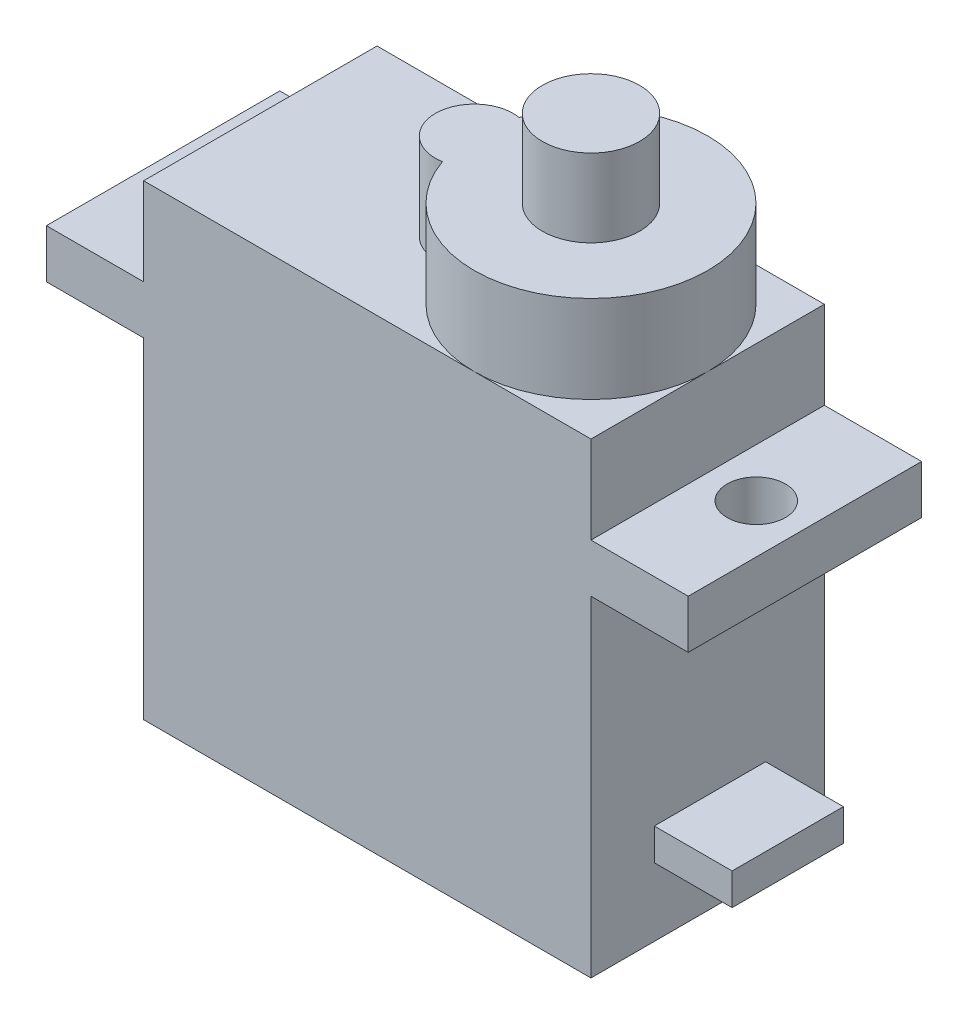
ISO-10303-21;
HEADER;
FILE_DESCRIPTION(('STEP AP214'),'2;1');
FILE_NAME('part.step','',(''),(''),'','','');
FILE_SCHEMA(('AUTOMOTIVE_DESIGN { 1 0 10303 214 1 1 1 1 }'));
ENDSEC;
DATA;
#1=APPLICATION_CONTEXT('core data for automotive mechanical design processes');
#2=APPLICATION_PROTOCOL_DEFINITION('international standard','automotive_design',2000,#1);
#3=PRODUCT_CONTEXT('',#1,'mechanical');
#4=PRODUCT('Part','Part','',(#3));
#5=PRODUCT_RELATED_PRODUCT_CATEGORY('part','',(#4));
#6=PRODUCT_DEFINITION_FORMATION('','',#4);
#7=PRODUCT_DEFINITION_CONTEXT('part definition',#1,'design');
#8=PRODUCT_DEFINITION('design','',#6,#7);
#9=PRODUCT_DEFINITION_SHAPE('','',#8);
#10=(LENGTH_UNIT() NAMED_UNIT(*) SI_UNIT(.MILLI.,.METRE.));
#11=(NAMED_UNIT(*) PLANE_ANGLE_UNIT() SI_UNIT($,.RADIAN.));
#12=(NAMED_UNIT(*) SI_UNIT($,.STERADIAN.) SOLID_ANGLE_UNIT());
#13=UNCERTAINTY_MEASURE_WITH_UNIT(LENGTH_MEASURE(1.E-05),#10,'distance_accuracy_value','');
#14=(GEOMETRIC_REPRESENTATION_CONTEXT(3) GLOBAL_UNCERTAINTY_ASSIGNED_CONTEXT((#13)) GLOBAL_UNIT_ASSIGNED_CONTEXT((#10,
#11,#12)) REPRESENTATION_CONTEXT('',''));
#15=CARTESIAN_POINT('',(0.,0.,0.));
#16=DIRECTION('',(0.,0.,1.));
#17=DIRECTION('',(1.,0.,0.));
#18=AXIS2_PLACEMENT_3D('',#15,#16,#17);
#19=CARTESIAN_POINT('',(11.4027072758037,24.,-4.76734348561759));
#20=DIRECTION('',(-1.,0.,0.));
#21=DIRECTION('',(0.,0.,1.));
#22=AXIS2_PLACEMENT_3D('',#19,#20,#21);
#23=PLANE('',#22);
#24=DIRECTION('',(0.,0.,-1.));
#25=VECTOR('',#24,1.);
#26=CARTESIAN_POINT('',(11.4027072758037,17.,7.23265651438241));
#27=LINE('',#26,#25);
#28=CARTESIAN_POINT('',(11.4027072758037,17.,7.23265651438241));
#29=VERTEX_POINT('',#28);
#30=CARTESIAN_POINT('',(11.4027072758037,17.,-4.76734348561759));
#31=VERTEX_POINT('',#30);
#32=EDGE_CURVE('E239',#29,#31,#27,.T.);
#33=ORIENTED_EDGE('',*,*,#32,.F.);
#34=DIRECTION('',(0.,-1.,0.));
#35=VECTOR('',#34,1.);
#36=CARTESIAN_POINT('',(11.4027072758037,24.,7.23265651438241));
#37=LINE('',#36,#35);
#38=CARTESIAN_POINT('',(11.4027072758037,0.,7.23265651438241));
#39=VERTEX_POINT('',#38);
#40=EDGE_CURVE('E317',#29,#39,#37,.T.);
#41=ORIENTED_EDGE('',*,*,#40,.T.);
#42=DIRECTION('',(0.,0.,-1.));
#43=VECTOR('',#42,1.);
#44=CARTESIAN_POINT('',(11.4027072758037,0.,-4.76734348561759));
#45=LINE('',#44,#43);
#46=CARTESIAN_POINT('',(11.4027072758037,0.,-4.76734348561759));
#47=VERTEX_POINT('',#46);
#48=EDGE_CURVE('E307',#39,#47,#45,.T.);
#49=ORIENTED_EDGE('',*,*,#48,.T.);
#50=DIRECTION('',(0.,-1.,0.));
#51=VECTOR('',#50,1.);
#52=CARTESIAN_POINT('',(11.4027072758037,24.,-4.76734348561759));
#53=LINE('',#52,#51);
#54=EDGE_CURVE('E314',#31,#47,#53,.T.);
#55=ORIENTED_EDGE('',*,*,#54,.F.);
#56=EDGE_LOOP('',(#33,#41,#49,#55));
#57=FACE_BOUND('',#56,.T.);
#58=DIRECTION('',(0.,-1.,0.));
#59=VECTOR('',#58,1.);
#60=CARTESIAN_POINT('',(11.4027072758037,3.50429810513822,3.97743538750271));
#61=LINE('',#60,#59);
#62=CARTESIAN_POINT('',(11.4027072758037,5.13948551891202,3.97743538750271));
#63=VERTEX_POINT('',#62);
#64=CARTESIAN_POINT('',(11.4027072758037,3.50429810513822,3.97743538750271));
#65=VERTEX_POINT('',#64);
#66=EDGE_CURVE('E194',#63,#65,#61,.T.);
#67=ORIENTED_EDGE('',*,*,#66,.F.);
#68=DIRECTION('',(0.,0.,1.));
#69=VECTOR('',#68,1.);
#70=CARTESIAN_POINT('',(11.4027072758037,5.13948551891202,3.97743538750271));
#71=LINE('',#70,#69);
#72=CARTESIAN_POINT('',(11.4027072758037,5.13948551891202,-1.74572056070559));
#73=VERTEX_POINT('',#72);
#74=EDGE_CURVE('E191',#73,#63,#71,.T.);
#75=ORIENTED_EDGE('',*,*,#74,.F.);
#76=DIRECTION('',(0.,1.,0.));
#77=VECTOR('',#76,1.);
#78=CARTESIAN_POINT('',(11.4027072758037,3.50429810513822,-1.74572056070559));
#79=LINE('',#78,#77);
#80=CARTESIAN_POINT('',(11.4027072758037,3.50429810513822,-1.74572056070559));
#81=VERTEX_POINT('',#80);
#82=EDGE_CURVE('E60',#81,#73,#79,.T.);
#83=ORIENTED_EDGE('',*,*,#82,.F.);
#84=DIRECTION('',(0.,0.,-1.));
#85=VECTOR('',#84,1.);
#86=CARTESIAN_POINT('',(11.4027072758037,3.50429810513822,3.97743538750271));
#87=LINE('',#86,#85);
#88=EDGE_CURVE('E55',#65,#81,#87,.T.);
#89=ORIENTED_EDGE('',*,*,#88,.F.);
#90=EDGE_LOOP('',(#67,#75,#83,#89));
#91=FACE_BOUND('',#90,.T.);
#92=ADVANCED_FACE('F37',(#57,#91),#23,.F.);
#93=CARTESIAN_POINT('',(-11.5972927241963,24.,-4.76734348561759));
#94=DIRECTION('',(1.,0.,0.));
#95=DIRECTION('',(0.,0.,-1.));
#96=AXIS2_PLACEMENT_3D('',#93,#94,#95);
#97=PLANE('',#96);
#98=DIRECTION('',(0.,0.,-1.));
#99=VECTOR('',#98,1.);
#100=CARTESIAN_POINT('',(-11.5972927241963,19.5,-4.76734348561759));
#101=LINE('',#100,#99);
#102=CARTESIAN_POINT('',(-11.5972927241963,19.5,7.23265651438241));
#103=VERTEX_POINT('',#102);
#104=CARTESIAN_POINT('',(-11.5972927241963,19.5,-4.76734348561759));
#105=VERTEX_POINT('',#104);
#106=EDGE_CURVE('E217',#103,#105,#101,.T.);
#107=ORIENTED_EDGE('',*,*,#106,.F.);
#108=DIRECTION('',(0.,-1.,0.));
#109=VECTOR('',#108,1.);
#110=CARTESIAN_POINT('',(-11.5972927241963,24.,7.23265651438241));
#111=LINE('',#110,#109);
#112=CARTESIAN_POINT('',(-11.5972927241963,24.,7.23265651438241));
#113=VERTEX_POINT('',#112);
#114=EDGE_CURVE('E41',#113,#103,#111,.T.);
#115=ORIENTED_EDGE('',*,*,#114,.F.);
#116=DIRECTION('',(0.,0.,1.));
#117=VECTOR('',#116,1.);
#118=CARTESIAN_POINT('',(-11.5972927241963,24.,-4.76734348561759));
#119=LINE('',#118,#117);
#120=CARTESIAN_POINT('',(-11.5972927241963,24.,-4.76734348561759));
#121=VERTEX_POINT('',#120);
#122=EDGE_CURVE('E285',#121,#113,#119,.T.);
#123=ORIENTED_EDGE('',*,*,#122,.F.);
#124=DIRECTION('',(0.,-1.,0.));
#125=VECTOR('',#124,1.);
#126=CARTESIAN_POINT('',(-11.5972927241963,24.,-4.76734348561759));
#127=LINE('',#126,#125);
#128=EDGE_CURVE('E312',#121,#105,#127,.T.);
#129=ORIENTED_EDGE('',*,*,#128,.T.);
#130=EDGE_LOOP('',(#107,#115,#123,#129));
#131=FACE_BOUND('',#130,.T.);
#132=ADVANCED_FACE('F39',(#131),#97,.F.);
#133=DIRECTION('',(0.,0.,1.));
#134=VECTOR('',#133,1.);
#135=CARTESIAN_POINT('',(-11.5972927241963,17.,-4.76734348561759));
#136=LINE('',#135,#134);
#137=CARTESIAN_POINT('',(-11.5972927241963,17.,-4.76734348561759));
#138=VERTEX_POINT('',#137);
#139=CARTESIAN_POINT('',(-11.5972927241963,17.,7.23265651438241));
#140=VERTEX_POINT('',#139);
#141=EDGE_CURVE('E212',#138,#140,#136,.T.);
#142=ORIENTED_EDGE('',*,*,#141,.F.);
#143=CARTESIAN_POINT('',(-11.5972927241963,0.,-4.76734348561759));
#144=VERTEX_POINT('',#143);
#145=EDGE_CURVE('E301',#138,#144,#127,.T.);
#146=ORIENTED_EDGE('',*,*,#145,.T.);
#147=DIRECTION('',(0.,0.,1.));
#148=VECTOR('',#147,1.);
#149=CARTESIAN_POINT('',(-11.5972927241963,0.,-4.76734348561759));
#150=LINE('',#149,#148);
#151=CARTESIAN_POINT('',(-11.5972927241963,0.,7.23265651438241));
#152=VERTEX_POINT('',#151);
#153=EDGE_CURVE('E284',#144,#152,#150,.T.);
#154=ORIENTED_EDGE('',*,*,#153,.T.);
#155=EDGE_CURVE('E320',#140,#152,#111,.T.);
#156=ORIENTED_EDGE('',*,*,#155,.F.);
#157=EDGE_LOOP('',(#142,#146,#154,#156));
#158=FACE_BOUND('',#157,.T.);
#159=ADVANCED_FACE('F385',(#158),#97,.F.);
#160=DIRECTION('',(0.,0.,1.));
#161=VECTOR('',#160,1.);
#162=CARTESIAN_POINT('',(11.4027072758037,19.5,7.23265651438241));
#163=LINE('',#162,#161);
#164=CARTESIAN_POINT('',(11.4027072758037,19.5,-4.76734348561759));
#165=VERTEX_POINT('',#164);
#166=CARTESIAN_POINT('',(11.4027072758037,19.5,7.23265651438241));
#167=VERTEX_POINT('',#166);
#168=EDGE_CURVE('E244',#165,#167,#163,.T.);
#169=ORIENTED_EDGE('',*,*,#168,.F.);
#170=CARTESIAN_POINT('',(11.4027072758037,24.,-4.76734348561759));
#171=VERTEX_POINT('',#170);
#172=EDGE_CURVE('E315',#171,#165,#53,.T.);
#173=ORIENTED_EDGE('',*,*,#172,.F.);
#174=DIRECTION('',(0.,0.,-1.));
#175=VECTOR('',#174,1.);
#176=CARTESIAN_POINT('',(11.4027072758037,24.,-4.76734348561759));
#177=LINE('',#176,#175);
#178=CARTESIAN_POINT('',(11.4027072758037,24.,1.23265651438241));
#179=VERTEX_POINT('',#178);
#180=EDGE_CURVE('E293',#179,#171,#177,.T.);
#181=ORIENTED_EDGE('',*,*,#180,.F.);
#182=CARTESIAN_POINT('',(11.4027072758037,24.,7.23265651438241));
#183=VERTEX_POINT('',#182);
#184=EDGE_CURVE('E294',#183,#179,#177,.T.);
#185=ORIENTED_EDGE('',*,*,#184,.F.);
#186=EDGE_CURVE('E318',#183,#167,#37,.T.);
#187=ORIENTED_EDGE('',*,*,#186,.T.);
#188=EDGE_LOOP('',(#169,#173,#181,#185,#187));
#189=FACE_BOUND('',#188,.T.);
#190=ADVANCED_FACE('F355',(#189),#23,.F.);
#191=CARTESIAN_POINT('',(0.,24.,0.));
#192=DIRECTION('',(0.,1.,0.));
#193=DIRECTION('',(0.,0.,1.));
#194=AXIS2_PLACEMENT_3D('',#191,#192,#193);
#195=PLANE('',#194);
#196=CARTESIAN_POINT('',(-0.597292724196278,24.,1.23265651438241));
#197=DIRECTION('',(0.,1.,0.));
#198=DIRECTION('',(0.,0.,1.));
#199=AXIS2_PLACEMENT_3D('',#196,#197,#198);
#200=CIRCLE('',#199,2.);
#201=CARTESIAN_POINT('',(-0.263959390862941,24.,-0.739370079984138));
#202=VERTEX_POINT('',#201);
#203=CARTESIAN_POINT('',(-0.263959390862944,24.,3.20468310874894));
#204=VERTEX_POINT('',#203);
#205=EDGE_CURVE('E266',#202,#204,#200,.T.);
#206=ORIENTED_EDGE('',*,*,#205,.F.);
#207=CARTESIAN_POINT('',(5.40270727580372,24.,1.23265651438241));
#208=DIRECTION('',(0.,1.,0.));
#209=DIRECTION('',(0.,0.,1.));
#210=AXIS2_PLACEMENT_3D('',#207,#208,#209);
#211=CIRCLE('',#210,6.);
#212=CARTESIAN_POINT('',(5.40270727580372,24.,-4.76734348561759));
#213=VERTEX_POINT('',#212);
#214=EDGE_CURVE('E278',#213,#202,#211,.T.);
#215=ORIENTED_EDGE('',*,*,#214,.F.);
#216=DIRECTION('',(-1.,0.,0.));
#217=VECTOR('',#216,1.);
#218=CARTESIAN_POINT('',(-11.5972927241963,24.,-4.76734348561759));
#219=LINE('',#218,#217);
#220=EDGE_CURVE('E297',#213,#121,#219,.T.);
#221=ORIENTED_EDGE('',*,*,#220,.T.);
#222=ORIENTED_EDGE('',*,*,#122,.T.);
#223=DIRECTION('',(1.,0.,0.));
#224=VECTOR('',#223,1.);
#225=CARTESIAN_POINT('',(-11.5972927241963,24.,7.23265651438241));
#226=LINE('',#225,#224);
#227=CARTESIAN_POINT('',(5.40270727580372,24.,7.23265651438241));
#228=VERTEX_POINT('',#227);
#229=EDGE_CURVE('E290',#113,#228,#226,.T.);
#230=ORIENTED_EDGE('',*,*,#229,.T.);
#231=EDGE_CURVE('E48',#204,#228,#211,.T.);
#232=ORIENTED_EDGE('',*,*,#231,.F.);
#233=EDGE_LOOP('',(#206,#215,#221,#222,#230,#232));
#234=FACE_BOUND('',#233,.T.);
#235=ADVANCED_FACE('F392',(#234),#195,.T.);
#236=EDGE_CURVE('E11',#228,#179,#211,.T.);
#237=ORIENTED_EDGE('',*,*,#236,.F.);
#238=EDGE_CURVE('E288',#228,#183,#226,.T.);
#239=ORIENTED_EDGE('',*,*,#238,.T.);
#240=ORIENTED_EDGE('',*,*,#184,.T.);
#241=EDGE_LOOP('',(#237,#239,#240));
#242=FACE_BOUND('',#241,.T.);
#243=ADVANCED_FACE('F402',(#242),#195,.T.);
#244=CARTESIAN_POINT('',(-11.5972927241963,24.,7.23265651438241));
#245=DIRECTION('',(0.,0.,-1.));
#246=DIRECTION('',(-1.,0.,0.));
#247=AXIS2_PLACEMENT_3D('',#244,#245,#246);
#248=PLANE('',#247);
#249=DIRECTION('',(1.,0.,0.));
#250=VECTOR('',#249,1.);
#251=CARTESIAN_POINT('',(-11.5972927241963,0.,7.23265651438241));
#252=LINE('',#251,#250);
#253=EDGE_CURVE('E304',#152,#39,#252,.T.);
#254=ORIENTED_EDGE('',*,*,#253,.T.);
#255=ORIENTED_EDGE('',*,*,#40,.F.);
#256=DIRECTION('',(-1.,0.,0.));
#257=VECTOR('',#256,1.);
#258=CARTESIAN_POINT('',(16.4027072758037,17.,7.23265651438241));
#259=LINE('',#258,#257);
#260=CARTESIAN_POINT('',(16.4027072758037,17.,7.23265651438241));
#261=VERTEX_POINT('',#260);
#262=EDGE_CURVE('E260',#261,#29,#259,.T.);
#263=ORIENTED_EDGE('',*,*,#262,.F.);
#264=DIRECTION('',(0.,-1.,0.));
#265=VECTOR('',#264,1.);
#266=CARTESIAN_POINT('',(16.4027072758037,19.5,7.23265651438241));
#267=LINE('',#266,#265);
#268=CARTESIAN_POINT('',(16.4027072758037,19.5,7.23265651438241));
#269=VERTEX_POINT('',#268);
#270=EDGE_CURVE('E240',#269,#261,#267,.T.);
#271=ORIENTED_EDGE('',*,*,#270,.F.);
#272=DIRECTION('',(-1.,0.,0.));
#273=VECTOR('',#272,1.);
#274=CARTESIAN_POINT('',(16.4027072758037,19.5,7.23265651438241));
#275=LINE('',#274,#273);
#276=EDGE_CURVE('E250',#269,#167,#275,.T.);
#277=ORIENTED_EDGE('',*,*,#276,.T.);
#278=ORIENTED_EDGE('',*,*,#186,.F.);
#279=ORIENTED_EDGE('',*,*,#238,.F.);
#280=ORIENTED_EDGE('',*,*,#229,.F.);
#281=ORIENTED_EDGE('',*,*,#114,.T.);
#282=DIRECTION('',(1.,0.,0.));
#283=VECTOR('',#282,1.);
#284=CARTESIAN_POINT('',(-16.5972927241963,19.5,7.23265651438241));
#285=LINE('',#284,#283);
#286=CARTESIAN_POINT('',(-16.5972927241963,19.5,7.23265651438241));
#287=VERTEX_POINT('',#286);
#288=EDGE_CURVE('E230',#287,#103,#285,.T.);
#289=ORIENTED_EDGE('',*,*,#288,.F.);
#290=DIRECTION('',(0.,1.,0.));
#291=VECTOR('',#290,1.);
#292=CARTESIAN_POINT('',(-16.5972927241963,19.5,7.23265651438241));
#293=LINE('',#292,#291);
#294=CARTESIAN_POINT('',(-16.5972927241963,17.,7.23265651438241));
#295=VERTEX_POINT('',#294);
#296=EDGE_CURVE('E219',#295,#287,#293,.T.);
#297=ORIENTED_EDGE('',*,*,#296,.F.);
#298=DIRECTION('',(1.,0.,0.));
#299=VECTOR('',#298,1.);
#300=CARTESIAN_POINT('',(-16.5972927241963,17.,7.23265651438241));
#301=LINE('',#300,#299);
#302=EDGE_CURVE('E233',#295,#140,#301,.T.);
#303=ORIENTED_EDGE('',*,*,#302,.T.);
#304=ORIENTED_EDGE('',*,*,#155,.T.);
#305=EDGE_LOOP('',(#254,#255,#263,#271,#277,#278,#279,#280,#281,#289,#297,#303,#304));
#306=FACE_BOUND('',#305,.T.);
#307=ADVANCED_FACE('F334',(#306),#248,.F.);
#308=CARTESIAN_POINT('',(-11.5972927241963,24.,-4.76734348561759));
#309=DIRECTION('',(0.,0.,1.));
#310=DIRECTION('',(1.,0.,0.));
#311=AXIS2_PLACEMENT_3D('',#308,#309,#310);
#312=PLANE('',#311);
#313=DIRECTION('',(-1.,0.,0.));
#314=VECTOR('',#313,1.);
#315=CARTESIAN_POINT('',(-11.5972927241963,0.,-4.76734348561759));
#316=LINE('',#315,#314);
#317=EDGE_CURVE('E289',#47,#144,#316,.T.);
#318=ORIENTED_EDGE('',*,*,#317,.T.);
#319=ORIENTED_EDGE('',*,*,#145,.F.);
#320=DIRECTION('',(1.,0.,0.));
#321=VECTOR('',#320,1.);
#322=CARTESIAN_POINT('',(-16.5972927241963,17.,-4.76734348561759));
#323=LINE('',#322,#321);
#324=CARTESIAN_POINT('',(-16.5972927241963,17.,-4.76734348561759));
#325=VERTEX_POINT('',#324);
#326=EDGE_CURVE('E236',#325,#138,#323,.T.);
#327=ORIENTED_EDGE('',*,*,#326,.F.);
#328=DIRECTION('',(0.,-1.,0.));
#329=VECTOR('',#328,1.);
#330=CARTESIAN_POINT('',(-16.5972927241963,19.5,-4.76734348561759));
#331=LINE('',#330,#329);
#332=CARTESIAN_POINT('',(-16.5972927241963,19.5,-4.76734348561759));
#333=VERTEX_POINT('',#332);
#334=EDGE_CURVE('E213',#333,#325,#331,.T.);
#335=ORIENTED_EDGE('',*,*,#334,.F.);
#336=DIRECTION('',(1.,0.,0.));
#337=VECTOR('',#336,1.);
#338=CARTESIAN_POINT('',(-16.5972927241963,19.5,-4.76734348561759));
#339=LINE('',#338,#337);
#340=EDGE_CURVE('E223',#333,#105,#339,.T.);
#341=ORIENTED_EDGE('',*,*,#340,.T.);
#342=ORIENTED_EDGE('',*,*,#128,.F.);
#343=ORIENTED_EDGE('',*,*,#220,.F.);
#344=EDGE_CURVE('E298',#171,#213,#219,.T.);
#345=ORIENTED_EDGE('',*,*,#344,.F.);
#346=ORIENTED_EDGE('',*,*,#172,.T.);
#347=DIRECTION('',(-1.,0.,0.));
#348=VECTOR('',#347,1.);
#349=CARTESIAN_POINT('',(16.4027072758037,19.5,-4.76734348561759));
#350=LINE('',#349,#348);
#351=CARTESIAN_POINT('',(16.4027072758037,19.5,-4.76734348561759));
#352=VERTEX_POINT('',#351);
#353=EDGE_CURVE('E256',#352,#165,#350,.T.);
#354=ORIENTED_EDGE('',*,*,#353,.F.);
#355=DIRECTION('',(0.,1.,0.));
#356=VECTOR('',#355,1.);
#357=CARTESIAN_POINT('',(16.4027072758037,19.5,-4.76734348561759));
#358=LINE('',#357,#356);
#359=CARTESIAN_POINT('',(16.4027072758037,17.,-4.76734348561759));
#360=VERTEX_POINT('',#359);
#361=EDGE_CURVE('E246',#360,#352,#358,.T.);
#362=ORIENTED_EDGE('',*,*,#361,.F.);
#363=DIRECTION('',(-1.,0.,0.));
#364=VECTOR('',#363,1.);
#365=CARTESIAN_POINT('',(16.4027072758037,17.,-4.76734348561759));
#366=LINE('',#365,#364);
#367=EDGE_CURVE('E258',#360,#31,#366,.T.);
#368=ORIENTED_EDGE('',*,*,#367,.T.);
#369=ORIENTED_EDGE('',*,*,#54,.T.);
#370=EDGE_LOOP('',(#318,#319,#327,#335,#341,#342,#343,#345,#346,#354,#362,#368,#369));
#371=FACE_BOUND('',#370,.T.);
#372=ADVANCED_FACE('F340',(#371),#312,.F.);
#373=EDGE_CURVE('E46',#179,#213,#211,.T.);
#374=ORIENTED_EDGE('',*,*,#373,.F.);
#375=ORIENTED_EDGE('',*,*,#180,.T.);
#376=ORIENTED_EDGE('',*,*,#344,.T.);
#377=EDGE_LOOP('',(#374,#375,#376));
#378=FACE_BOUND('',#377,.T.);
#379=ADVANCED_FACE('F362',(#378),#195,.T.);
#380=CARTESIAN_POINT('',(0.,0.,0.));
#381=DIRECTION('',(0.,1.,0.));
#382=DIRECTION('',(0.,0.,1.));
#383=AXIS2_PLACEMENT_3D('',#380,#381,#382);
#384=PLANE('',#383);
#385=ORIENTED_EDGE('',*,*,#153,.F.);
#386=ORIENTED_EDGE('',*,*,#317,.F.);
#387=ORIENTED_EDGE('',*,*,#48,.F.);
#388=ORIENTED_EDGE('',*,*,#253,.F.);
#389=EDGE_LOOP('',(#385,#386,#387,#388));
#390=FACE_BOUND('',#389,.T.);
#391=ADVANCED_FACE('F337',(#390),#384,.F.);
#392=CARTESIAN_POINT('',(-0.597292724196278,28.5,1.23265651438241));
#393=DIRECTION('',(0.,-1.,0.));
#394=DIRECTION('',(0.,0.,-1.));
#395=AXIS2_PLACEMENT_3D('',#392,#393,#394);
#396=CYLINDRICAL_SURFACE('',#395,2.);
#397=ORIENTED_EDGE('',*,*,#205,.T.);
#398=DIRECTION('',(0.,-1.,0.));
#399=VECTOR('',#398,1.);
#400=CARTESIAN_POINT('',(-0.263959390862944,28.5,3.20468310874894));
#401=LINE('',#400,#399);
#402=CARTESIAN_POINT('',(-0.263959390862944,28.5,3.20468310874894));
#403=VERTEX_POINT('',#402);
#404=EDGE_CURVE('E281',#403,#204,#401,.T.);
#405=ORIENTED_EDGE('',*,*,#404,.F.);
#406=CARTESIAN_POINT('',(-0.597292724196278,28.5,1.23265651438241));
#407=DIRECTION('',(0.,1.,0.));
#408=DIRECTION('',(0.,0.,1.));
#409=AXIS2_PLACEMENT_3D('',#406,#407,#408);
#410=CIRCLE('',#409,2.);
#411=CARTESIAN_POINT('',(-0.263959390862941,28.5,-0.739370079984138));
#412=VERTEX_POINT('',#411);
#413=EDGE_CURVE('E269',#412,#403,#410,.T.);
#414=ORIENTED_EDGE('',*,*,#413,.F.);
#415=DIRECTION('',(0.,-1.,0.));
#416=VECTOR('',#415,1.);
#417=CARTESIAN_POINT('',(-0.263959390862941,28.5,-0.739370079984138));
#418=LINE('',#417,#416);
#419=EDGE_CURVE('E274',#412,#202,#418,.T.);
#420=ORIENTED_EDGE('',*,*,#419,.T.);
#421=EDGE_LOOP('',(#397,#405,#414,#420));
#422=FACE_BOUND('',#421,.T.);
#423=ADVANCED_FACE('F418',(#422),#396,.T.);
#424=CARTESIAN_POINT('',(5.40270727580372,28.5,1.23265651438241));
#425=DIRECTION('',(0.,-1.,0.));
#426=DIRECTION('',(0.,0.,-1.));
#427=AXIS2_PLACEMENT_3D('',#424,#425,#426);
#428=CYLINDRICAL_SURFACE('',#427,6.);
#429=ORIENTED_EDGE('',*,*,#231,.T.);
#430=ORIENTED_EDGE('',*,*,#236,.T.);
#431=ORIENTED_EDGE('',*,*,#373,.T.);
#432=ORIENTED_EDGE('',*,*,#214,.T.);
#433=ORIENTED_EDGE('',*,*,#419,.F.);
#434=CARTESIAN_POINT('',(5.40270727580372,28.5,1.23265651438241));
#435=DIRECTION('',(0.,1.,0.));
#436=DIRECTION('',(0.,0.,1.));
#437=AXIS2_PLACEMENT_3D('',#434,#435,#436);
#438=CIRCLE('',#437,6.);
#439=EDGE_CURVE('E272',#403,#412,#438,.T.);
#440=ORIENTED_EDGE('',*,*,#439,.F.);
#441=ORIENTED_EDGE('',*,*,#404,.T.);
#442=EDGE_LOOP('',(#429,#430,#431,#432,#433,#440,#441));
#443=FACE_BOUND('',#442,.T.);
#444=ADVANCED_FACE('F365',(#443),#428,.T.);
#445=CARTESIAN_POINT('',(2.40270727580372,28.5,1.23265651438241));
#446=DIRECTION('',(0.,1.,0.));
#447=DIRECTION('',(0.,0.,1.));
#448=AXIS2_PLACEMENT_3D('',#445,#446,#447);
#449=PLANE('',#448);
#450=CARTESIAN_POINT('',(5.40270727580372,28.5,1.23265651438241));
#451=DIRECTION('',(0.,1.,0.));
#452=DIRECTION('',(0.,0.,1.));
#453=AXIS2_PLACEMENT_3D('',#450,#451,#452);
#454=CIRCLE('',#453,2.5);
#455=CARTESIAN_POINT('',(5.40270727580372,28.5,3.73265651438241));
#456=VERTEX_POINT('',#455);
#457=EDGE_CURVE('E262',#456,#456,#454,.T.);
#458=ORIENTED_EDGE('',*,*,#457,.F.);
#459=EDGE_LOOP('',(#458));
#460=FACE_BOUND('',#459,.T.);
#461=ORIENTED_EDGE('',*,*,#413,.T.);
#462=ORIENTED_EDGE('',*,*,#439,.T.);
#463=EDGE_LOOP('',(#461,#462));
#464=FACE_BOUND('',#463,.T.);
#465=ADVANCED_FACE('F426',(#460,#464),#449,.T.);
#466=CARTESIAN_POINT('',(5.40270727580372,32.5,1.23265651438241));
#467=DIRECTION('',(0.,-1.,0.));
#468=DIRECTION('',(0.,0.,-1.));
#469=AXIS2_PLACEMENT_3D('',#466,#467,#468);
#470=CYLINDRICAL_SURFACE('',#469,2.5);
#471=CARTESIAN_POINT('',(5.40270727580372,32.5,1.23265651438241));
#472=DIRECTION('',(0.,1.,0.));
#473=DIRECTION('',(0.,0.,1.));
#474=AXIS2_PLACEMENT_3D('',#471,#472,#473);
#475=CIRCLE('',#474,2.5);
#476=CARTESIAN_POINT('',(5.40270727580372,32.5,3.73265651438241));
#477=VERTEX_POINT('',#476);
#478=EDGE_CURVE('E263',#477,#477,#475,.T.);
#479=ORIENTED_EDGE('',*,*,#478,.F.);
#480=EDGE_LOOP('',(#479));
#481=FACE_BOUND('',#480,.T.);
#482=ORIENTED_EDGE('',*,*,#457,.T.);
#483=EDGE_LOOP('',(#482));
#484=FACE_BOUND('',#483,.T.);
#485=ADVANCED_FACE('F431',(#481,#484),#470,.T.);
#486=CARTESIAN_POINT('',(5.40270727580372,32.5,1.23265651438241));
#487=DIRECTION('',(0.,1.,0.));
#488=DIRECTION('',(0.,0.,1.));
#489=AXIS2_PLACEMENT_3D('',#486,#487,#488);
#490=PLANE('',#489);
#491=ORIENTED_EDGE('',*,*,#478,.T.);
#492=EDGE_LOOP('',(#491));
#493=FACE_BOUND('',#492,.T.);
#494=ADVANCED_FACE('F435',(#493),#490,.T.);
#495=CARTESIAN_POINT('',(16.4027072758037,17.,7.23265651438241));
#496=DIRECTION('',(0.,1.,0.));
#497=DIRECTION('',(0.,0.,1.));
#498=AXIS2_PLACEMENT_3D('',#495,#496,#497);
#499=PLANE('',#498);
#500=CARTESIAN_POINT('',(13.9027072758037,17.,1.23265651438241));
#501=DIRECTION('',(0.,1.,0.));
#502=DIRECTION('',(0.,0.,1.));
#503=AXIS2_PLACEMENT_3D('',#500,#501,#502);
#504=CIRCLE('',#503,1.5);
#505=CARTESIAN_POINT('',(13.9027072758037,17.,2.73265651438241));
#506=VERTEX_POINT('',#505);
#507=EDGE_CURVE('E209',#506,#506,#504,.T.);
#508=ORIENTED_EDGE('',*,*,#507,.T.);
#509=EDGE_LOOP('',(#508));
#510=FACE_BOUND('',#509,.T.);
#511=ORIENTED_EDGE('',*,*,#32,.T.);
#512=ORIENTED_EDGE('',*,*,#367,.F.);
#513=DIRECTION('',(0.,0.,-1.));
#514=VECTOR('',#513,1.);
#515=CARTESIAN_POINT('',(16.4027072758037,17.,7.23265651438241));
#516=LINE('',#515,#514);
#517=EDGE_CURVE('E243',#261,#360,#516,.T.);
#518=ORIENTED_EDGE('',*,*,#517,.F.);
#519=ORIENTED_EDGE('',*,*,#262,.T.);
#520=EDGE_LOOP('',(#511,#512,#518,#519));
#521=FACE_BOUND('',#520,.T.);
#522=ADVANCED_FACE('F346',(#510,#521),#499,.F.);
#523=CARTESIAN_POINT('',(16.4027072758037,19.5,7.23265651438241));
#524=DIRECTION('',(0.,-1.,0.));
#525=DIRECTION('',(0.,0.,-1.));
#526=AXIS2_PLACEMENT_3D('',#523,#524,#525);
#527=PLANE('',#526);
#528=CARTESIAN_POINT('',(13.9027072758037,19.5,1.23265651438241));
#529=DIRECTION('',(0.,1.,0.));
#530=DIRECTION('',(0.,0.,1.));
#531=AXIS2_PLACEMENT_3D('',#528,#529,#530);
#532=CIRCLE('',#531,1.5);
#533=CARTESIAN_POINT('',(13.9027072758037,19.5,2.73265651438241));
#534=VERTEX_POINT('',#533);
#535=EDGE_CURVE('E195',#534,#534,#532,.T.);
#536=ORIENTED_EDGE('',*,*,#535,.F.);
#537=EDGE_LOOP('',(#536));
#538=FACE_BOUND('',#537,.T.);
#539=ORIENTED_EDGE('',*,*,#168,.T.);
#540=ORIENTED_EDGE('',*,*,#276,.F.);
#541=DIRECTION('',(0.,0.,1.));
#542=VECTOR('',#541,1.);
#543=CARTESIAN_POINT('',(16.4027072758037,19.5,7.23265651438241));
#544=LINE('',#543,#542);
#545=EDGE_CURVE('E248',#352,#269,#544,.T.);
#546=ORIENTED_EDGE('',*,*,#545,.F.);
#547=ORIENTED_EDGE('',*,*,#353,.T.);
#548=EDGE_LOOP('',(#539,#540,#546,#547));
#549=FACE_BOUND('',#548,.T.);
#550=ADVANCED_FACE('F353',(#538,#549),#527,.F.);
#551=CARTESIAN_POINT('',(16.4027072758037,0.,0.));
#552=DIRECTION('',(1.,0.,0.));
#553=DIRECTION('',(0.,0.,-1.));
#554=AXIS2_PLACEMENT_3D('',#551,#552,#553);
#555=PLANE('',#554);
#556=ORIENTED_EDGE('',*,*,#270,.T.);
#557=ORIENTED_EDGE('',*,*,#517,.T.);
#558=ORIENTED_EDGE('',*,*,#361,.T.);
#559=ORIENTED_EDGE('',*,*,#545,.T.);
#560=EDGE_LOOP('',(#556,#557,#558,#559));
#561=FACE_BOUND('',#560,.T.);
#562=ADVANCED_FACE('F350',(#561),#555,.T.);
#563=CARTESIAN_POINT('',(-16.5972927241963,17.,-4.76734348561759));
#564=DIRECTION('',(0.,1.,0.));
#565=DIRECTION('',(0.,0.,1.));
#566=AXIS2_PLACEMENT_3D('',#563,#564,#565);
#567=PLANE('',#566);
#568=CARTESIAN_POINT('',(-14.0972927241963,17.,1.23265651438241));
#569=DIRECTION('',(0.,1.,0.));
#570=DIRECTION('',(0.,0.,1.));
#571=AXIS2_PLACEMENT_3D('',#568,#569,#570);
#572=CIRCLE('',#571,1.5);
#573=CARTESIAN_POINT('',(-14.0972927241963,17.,2.7326565143824));
#574=VERTEX_POINT('',#573);
#575=EDGE_CURVE('E205',#574,#574,#572,.T.);
#576=ORIENTED_EDGE('',*,*,#575,.T.);
#577=EDGE_LOOP('',(#576));
#578=FACE_BOUND('',#577,.T.);
#579=ORIENTED_EDGE('',*,*,#141,.T.);
#580=ORIENTED_EDGE('',*,*,#302,.F.);
#581=DIRECTION('',(0.,0.,1.));
#582=VECTOR('',#581,1.);
#583=CARTESIAN_POINT('',(-16.5972927241963,17.,-4.76734348561759));
#584=LINE('',#583,#582);
#585=EDGE_CURVE('E216',#325,#295,#584,.T.);
#586=ORIENTED_EDGE('',*,*,#585,.F.);
#587=ORIENTED_EDGE('',*,*,#326,.T.);
#588=EDGE_LOOP('',(#579,#580,#586,#587));
#589=FACE_BOUND('',#588,.T.);
#590=ADVANCED_FACE('F383',(#578,#589),#567,.F.);
#591=CARTESIAN_POINT('',(-16.5972927241963,19.5,-4.76734348561759));
#592=DIRECTION('',(0.,-1.,0.));
#593=DIRECTION('',(0.,0.,-1.));
#594=AXIS2_PLACEMENT_3D('',#591,#592,#593);
#595=PLANE('',#594);
#596=CARTESIAN_POINT('',(-14.0972927241963,19.5,1.23265651438241));
#597=DIRECTION('',(0.,1.,0.));
#598=DIRECTION('',(0.,0.,1.));
#599=AXIS2_PLACEMENT_3D('',#596,#597,#598);
#600=CIRCLE('',#599,1.5);
#601=CARTESIAN_POINT('',(-14.0972927241963,19.5,2.7326565143824));
#602=VERTEX_POINT('',#601);
#603=EDGE_CURVE('E198',#602,#602,#600,.T.);
#604=ORIENTED_EDGE('',*,*,#603,.F.);
#605=EDGE_LOOP('',(#604));
#606=FACE_BOUND('',#605,.T.);
#607=ORIENTED_EDGE('',*,*,#106,.T.);
#608=ORIENTED_EDGE('',*,*,#340,.F.);
#609=DIRECTION('',(0.,0.,-1.));
#610=VECTOR('',#609,1.);
#611=CARTESIAN_POINT('',(-16.5972927241963,19.5,-4.76734348561759));
#612=LINE('',#611,#610);
#613=EDGE_CURVE('E221',#287,#333,#612,.T.);
#614=ORIENTED_EDGE('',*,*,#613,.F.);
#615=ORIENTED_EDGE('',*,*,#288,.T.);
#616=EDGE_LOOP('',(#607,#608,#614,#615));
#617=FACE_BOUND('',#616,.T.);
#618=ADVANCED_FACE('F376',(#606,#617),#595,.F.);
#619=CARTESIAN_POINT('',(-16.5972927241963,0.,0.));
#620=DIRECTION('',(-1.,0.,0.));
#621=DIRECTION('',(0.,0.,1.));
#622=AXIS2_PLACEMENT_3D('',#619,#620,#621);
#623=PLANE('',#622);
#624=ORIENTED_EDGE('',*,*,#334,.T.);
#625=ORIENTED_EDGE('',*,*,#585,.T.);
#626=ORIENTED_EDGE('',*,*,#296,.T.);
#627=ORIENTED_EDGE('',*,*,#613,.T.);
#628=EDGE_LOOP('',(#624,#625,#626,#627));
#629=FACE_BOUND('',#628,.T.);
#630=ADVANCED_FACE('F380',(#629),#623,.T.);
#631=CARTESIAN_POINT('',(-14.0972927241963,14.5,1.23265651438241));
#632=DIRECTION('',(0.,1.,0.));
#633=DIRECTION('',(0.,0.,1.));
#634=AXIS2_PLACEMENT_3D('',#631,#632,#633);
#635=CYLINDRICAL_SURFACE('',#634,1.5);
#636=ORIENTED_EDGE('',*,*,#603,.T.);
#637=EDGE_LOOP('',(#636));
#638=FACE_BOUND('',#637,.T.);
#639=ORIENTED_EDGE('',*,*,#575,.F.);
#640=EDGE_LOOP('',(#639));
#641=FACE_BOUND('',#640,.T.);
#642=ADVANCED_FACE('F456',(#638,#641),#635,.F.);
#643=CARTESIAN_POINT('',(13.9027072758037,14.5,1.23265651438241));
#644=DIRECTION('',(0.,1.,0.));
#645=DIRECTION('',(0.,0.,1.));
#646=AXIS2_PLACEMENT_3D('',#643,#644,#645);
#647=CYLINDRICAL_SURFACE('',#646,1.5);
#648=ORIENTED_EDGE('',*,*,#535,.T.);
#649=EDGE_LOOP('',(#648));
#650=FACE_BOUND('',#649,.T.);
#651=ORIENTED_EDGE('',*,*,#507,.F.);
#652=EDGE_LOOP('',(#651));
#653=FACE_BOUND('',#652,.T.);
#654=ADVANCED_FACE('F457',(#650,#653),#647,.F.);
#655=CARTESIAN_POINT('',(15.4027072758037,3.50429810513822,3.97743538750271));
#656=DIRECTION('',(0.,0.,-1.));
#657=DIRECTION('',(-1.,0.,0.));
#658=AXIS2_PLACEMENT_3D('',#655,#656,#657);
#659=PLANE('',#658);
#660=ORIENTED_EDGE('',*,*,#66,.T.);
#661=DIRECTION('',(-1.,0.,0.));
#662=VECTOR('',#661,1.);
#663=CARTESIAN_POINT('',(15.4027072758037,3.50429810513822,3.97743538750271));
#664=LINE('',#663,#662);
#665=CARTESIAN_POINT('',(15.4027072758037,3.50429810513822,3.97743538750271));
#666=VERTEX_POINT('',#665);
#667=EDGE_CURVE('E175',#666,#65,#664,.T.);
#668=ORIENTED_EDGE('',*,*,#667,.F.);
#669=DIRECTION('',(0.,-1.,0.));
#670=VECTOR('',#669,1.);
#671=CARTESIAN_POINT('',(15.4027072758037,3.50429810513822,3.97743538750271));
#672=LINE('',#671,#670);
#673=CARTESIAN_POINT('',(15.4027072758037,5.13948551891202,3.97743538750271));
#674=VERTEX_POINT('',#673);
#675=EDGE_CURVE('E182',#674,#666,#672,.T.);
#676=ORIENTED_EDGE('',*,*,#675,.F.);
#677=DIRECTION('',(-1.,0.,0.));
#678=VECTOR('',#677,1.);
#679=CARTESIAN_POINT('',(15.4027072758037,5.13948551891202,3.97743538750271));
#680=LINE('',#679,#678);
#681=EDGE_CURVE('E698',#674,#63,#680,.T.);
#682=ORIENTED_EDGE('',*,*,#681,.T.);
#683=EDGE_LOOP('',(#660,#668,#676,#682));
#684=FACE_BOUND('',#683,.T.);
#685=ADVANCED_FACE('F193',(#684),#659,.F.);
#686=CARTESIAN_POINT('',(15.4027072758037,3.50429810513822,3.97743538750271));
#687=DIRECTION('',(0.,1.,0.));
#688=DIRECTION('',(0.,0.,1.));
#689=AXIS2_PLACEMENT_3D('',#686,#687,#688);
#690=PLANE('',#689);
#691=ORIENTED_EDGE('',*,*,#88,.T.);
#692=DIRECTION('',(-1.,0.,0.));
#693=VECTOR('',#692,1.);
#694=CARTESIAN_POINT('',(15.4027072758037,3.50429810513822,-1.74572056070559));
#695=LINE('',#694,#693);
#696=CARTESIAN_POINT('',(15.4027072758037,3.50429810513822,-1.74572056070559));
#697=VERTEX_POINT('',#696);
#698=EDGE_CURVE('E178',#697,#81,#695,.T.);
#699=ORIENTED_EDGE('',*,*,#698,.F.);
#700=DIRECTION('',(0.,0.,-1.));
#701=VECTOR('',#700,1.);
#702=CARTESIAN_POINT('',(15.4027072758037,3.50429810513822,3.97743538750271));
#703=LINE('',#702,#701);
#704=EDGE_CURVE('E171',#666,#697,#703,.T.);
#705=ORIENTED_EDGE('',*,*,#704,.F.);
#706=ORIENTED_EDGE('',*,*,#667,.T.);
#707=EDGE_LOOP('',(#691,#699,#705,#706));
#708=FACE_BOUND('',#707,.T.);
#709=ADVANCED_FACE('F173',(#708),#690,.F.);
#710=CARTESIAN_POINT('',(15.4027072758037,3.50429810513822,-1.74572056070559));
#711=DIRECTION('',(0.,0.,1.));
#712=DIRECTION('',(1.,0.,0.));
#713=AXIS2_PLACEMENT_3D('',#710,#711,#712);
#714=PLANE('',#713);
#715=ORIENTED_EDGE('',*,*,#82,.T.);
#716=DIRECTION('',(-1.,0.,0.));
#717=VECTOR('',#716,1.);
#718=CARTESIAN_POINT('',(15.4027072758037,5.13948551891202,-1.74572056070559));
#719=LINE('',#718,#717);
#720=CARTESIAN_POINT('',(15.4027072758037,5.13948551891202,-1.74572056070559));
#721=VERTEX_POINT('',#720);
#722=EDGE_CURVE('E200',#721,#73,#719,.T.);
#723=ORIENTED_EDGE('',*,*,#722,.F.);
#724=DIRECTION('',(0.,1.,0.));
#725=VECTOR('',#724,1.);
#726=CARTESIAN_POINT('',(15.4027072758037,3.50429810513822,-1.74572056070559));
#727=LINE('',#726,#725);
#728=EDGE_CURVE('E181',#697,#721,#727,.T.);
#729=ORIENTED_EDGE('',*,*,#728,.F.);
#730=ORIENTED_EDGE('',*,*,#698,.T.);
#731=EDGE_LOOP('',(#715,#723,#729,#730));
#732=FACE_BOUND('',#731,.T.);
#733=ADVANCED_FACE('F468',(#732),#714,.F.);
#734=CARTESIAN_POINT('',(15.4027072758037,5.13948551891202,3.97743538750271));
#735=DIRECTION('',(0.,-1.,0.));
#736=DIRECTION('',(0.,0.,-1.));
#737=AXIS2_PLACEMENT_3D('',#734,#735,#736);
#738=PLANE('',#737);
#739=ORIENTED_EDGE('',*,*,#74,.T.);
#740=ORIENTED_EDGE('',*,*,#681,.F.);
#741=DIRECTION('',(0.,0.,1.));
#742=VECTOR('',#741,1.);
#743=CARTESIAN_POINT('',(15.4027072758037,5.13948551891202,3.97743538750271));
#744=LINE('',#743,#742);
#745=EDGE_CURVE('E187',#721,#674,#744,.T.);
#746=ORIENTED_EDGE('',*,*,#745,.F.);
#747=ORIENTED_EDGE('',*,*,#722,.T.);
#748=EDGE_LOOP('',(#739,#740,#746,#747));
#749=FACE_BOUND('',#748,.T.);
#750=ADVANCED_FACE('F471',(#749),#738,.F.);
#751=CARTESIAN_POINT('',(15.4027072758037,0.,0.));
#752=DIRECTION('',(-1.,0.,0.));
#753=DIRECTION('',(0.,0.,1.));
#754=AXIS2_PLACEMENT_3D('',#751,#752,#753);
#755=PLANE('',#754);
#756=ORIENTED_EDGE('',*,*,#675,.T.);
#757=ORIENTED_EDGE('',*,*,#704,.T.);
#758=ORIENTED_EDGE('',*,*,#728,.T.);
#759=ORIENTED_EDGE('',*,*,#745,.T.);
#760=EDGE_LOOP('',(#756,#757,#758,#759));
#761=FACE_BOUND('',#760,.T.);
#762=ADVANCED_FACE('F185',(#761),#755,.F.);
#763=CLOSED_SHELL('',(#92,#132,#159,#190,#235,#243,#307,#372,#379,#391,#423,#444,#465,#485,#494,
#522,#550,#562,#590,#618,#630,#642,#654,#685,#709,#733,#750,#762));
#764=MANIFOLD_SOLID_BREP('B2',#763);
#765=ADVANCED_BREP_SHAPE_REPRESENTATION('',(#18,#764),#14);
#766=SHAPE_DEFINITION_REPRESENTATION(#9,#765);
ENDSEC;
END-ISO-10303-21;
